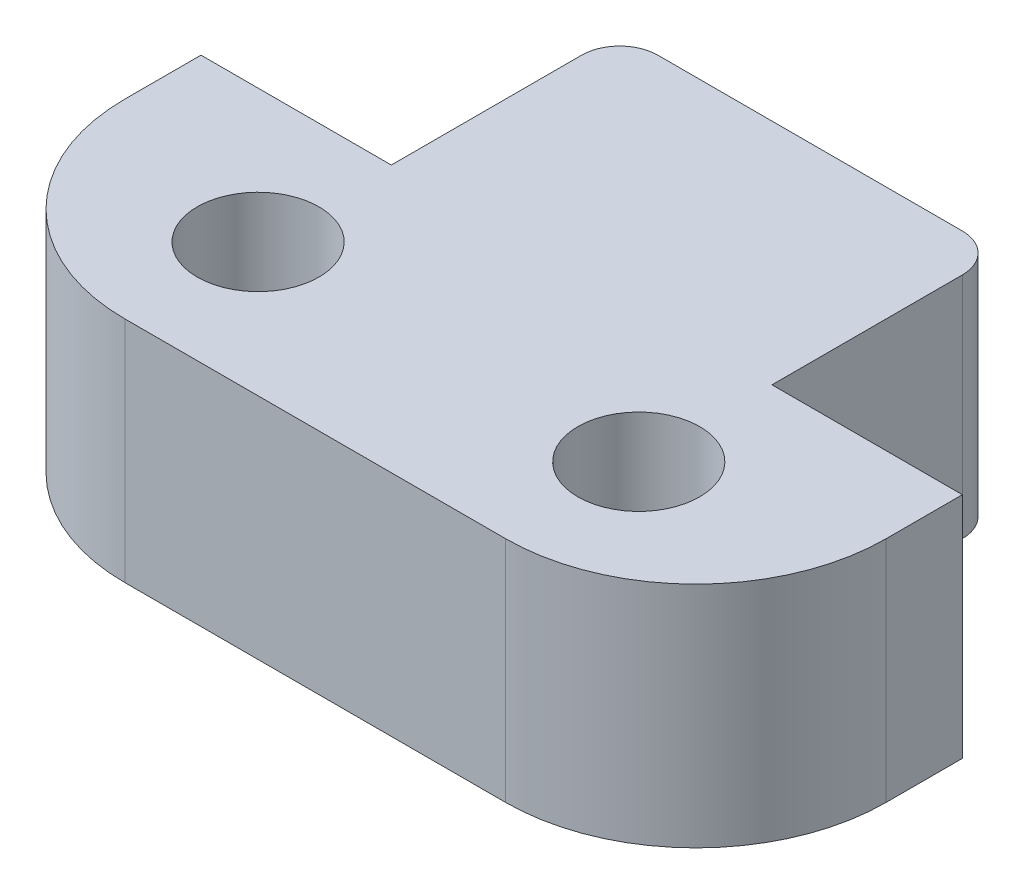
ISO-10303-21;
HEADER;
FILE_DESCRIPTION(('STEP AP214'),'2;1');
FILE_NAME('part.step','',(''),(''),'','','');
FILE_SCHEMA(('AUTOMOTIVE_DESIGN { 1 0 10303 214 1 1 1 1 }'));
ENDSEC;
DATA;
#1=APPLICATION_CONTEXT('core data for automotive mechanical design processes');
#2=APPLICATION_PROTOCOL_DEFINITION('international standard','automotive_design',2000,#1);
#3=PRODUCT_CONTEXT('',#1,'mechanical');
#4=PRODUCT('Part','Part','',(#3));
#5=PRODUCT_RELATED_PRODUCT_CATEGORY('part','',(#4));
#6=PRODUCT_DEFINITION_FORMATION('','',#4);
#7=PRODUCT_DEFINITION_CONTEXT('part definition',#1,'design');
#8=PRODUCT_DEFINITION('design','',#6,#7);
#9=PRODUCT_DEFINITION_SHAPE('','',#8);
#10=(LENGTH_UNIT() NAMED_UNIT(*) SI_UNIT(.MILLI.,.METRE.));
#11=(NAMED_UNIT(*) PLANE_ANGLE_UNIT() SI_UNIT($,.RADIAN.));
#12=(NAMED_UNIT(*) SI_UNIT($,.STERADIAN.) SOLID_ANGLE_UNIT());
#13=UNCERTAINTY_MEASURE_WITH_UNIT(LENGTH_MEASURE(1.E-05),#10,'distance_accuracy_value','');
#14=(GEOMETRIC_REPRESENTATION_CONTEXT(3) GLOBAL_UNCERTAINTY_ASSIGNED_CONTEXT((#13)) GLOBAL_UNIT_ASSIGNED_CONTEXT((#10,
#11,#12)) REPRESENTATION_CONTEXT('',''));
#15=CARTESIAN_POINT('',(0.,0.,0.));
#16=DIRECTION('',(0.,0.,1.));
#17=DIRECTION('',(1.,0.,0.));
#18=AXIS2_PLACEMENT_3D('',#15,#16,#17);
#19=CARTESIAN_POINT('',(-10.,6.,-3.5));
#20=DIRECTION('',(0.,0.,1.));
#21=DIRECTION('',(1.,0.,0.));
#22=AXIS2_PLACEMENT_3D('',#19,#20,#21);
#23=PLANE('',#22);
#24=DIRECTION('',(0.,1.,0.));
#25=VECTOR('',#24,1.);
#26=CARTESIAN_POINT('',(-5.00000000000005,6.00000000000001,-3.5));
#27=LINE('',#26,#25);
#28=CARTESIAN_POINT('',(-5.00000000000006,0.,-3.5));
#29=VERTEX_POINT('',#28);
#30=CARTESIAN_POINT('',(-5.00000000000006,6.,-3.5));
#31=VERTEX_POINT('',#30);
#32=EDGE_CURVE('E152',#29,#31,#27,.T.);
#33=ORIENTED_EDGE('',*,*,#32,.F.);
#34=DIRECTION('',(-1.,0.,0.));
#35=VECTOR('',#34,1.);
#36=CARTESIAN_POINT('',(-10.,0.,-3.5));
#37=LINE('',#36,#35);
#38=CARTESIAN_POINT('',(-10.,0.,-3.5));
#39=VERTEX_POINT('',#38);
#40=EDGE_CURVE('E147',#29,#39,#37,.T.);
#41=ORIENTED_EDGE('',*,*,#40,.T.);
#42=DIRECTION('',(0.,-1.,0.));
#43=VECTOR('',#42,1.);
#44=CARTESIAN_POINT('',(-10.,6.,-3.5));
#45=LINE('',#44,#43);
#46=CARTESIAN_POINT('',(-10.,6.,-3.5));
#47=VERTEX_POINT('',#46);
#48=EDGE_CURVE('E191',#47,#39,#45,.T.);
#49=ORIENTED_EDGE('',*,*,#48,.F.);
#50=DIRECTION('',(-1.,0.,0.));
#51=VECTOR('',#50,1.);
#52=CARTESIAN_POINT('',(-10.,6.,-3.5));
#53=LINE('',#52,#51);
#54=EDGE_CURVE('E163',#31,#47,#53,.T.);
#55=ORIENTED_EDGE('',*,*,#54,.F.);
#56=EDGE_LOOP('',(#33,#41,#49,#55));
#57=FACE_BOUND('',#56,.T.);
#58=ADVANCED_FACE('F33',(#57),#23,.F.);
#59=DIRECTION('',(0.,-1.,0.));
#60=VECTOR('',#59,1.);
#61=CARTESIAN_POINT('',(4.99999999999995,6.,-3.5));
#62=LINE('',#61,#60);
#63=CARTESIAN_POINT('',(4.99999999999994,6.,-3.5));
#64=VERTEX_POINT('',#63);
#65=CARTESIAN_POINT('',(4.99999999999994,0.,-3.5));
#66=VERTEX_POINT('',#65);
#67=EDGE_CURVE('E142',#64,#66,#62,.T.);
#68=ORIENTED_EDGE('',*,*,#67,.F.);
#69=CARTESIAN_POINT('',(10.,6.,-3.5));
#70=VERTEX_POINT('',#69);
#71=EDGE_CURVE('E180',#70,#64,#53,.T.);
#72=ORIENTED_EDGE('',*,*,#71,.F.);
#73=DIRECTION('',(0.,-1.,0.));
#74=VECTOR('',#73,1.);
#75=CARTESIAN_POINT('',(10.,6.,-3.5));
#76=LINE('',#75,#74);
#77=CARTESIAN_POINT('',(10.,0.,-3.5));
#78=VERTEX_POINT('',#77);
#79=EDGE_CURVE('E145',#70,#78,#76,.T.);
#80=ORIENTED_EDGE('',*,*,#79,.T.);
#81=EDGE_CURVE('E128',#78,#66,#37,.T.);
#82=ORIENTED_EDGE('',*,*,#81,.T.);
#83=EDGE_LOOP('',(#68,#72,#80,#82));
#84=FACE_BOUND('',#83,.T.);
#85=ADVANCED_FACE('F140',(#84),#23,.F.);
#86=CARTESIAN_POINT('',(10.,6.,-3.5));
#87=DIRECTION('',(-1.,0.,0.));
#88=DIRECTION('',(0.,0.,1.));
#89=AXIS2_PLACEMENT_3D('',#86,#87,#88);
#90=PLANE('',#89);
#91=DIRECTION('',(0.,0.,-1.));
#92=VECTOR('',#91,1.);
#93=CARTESIAN_POINT('',(10.,6.,-3.5));
#94=LINE('',#93,#92);
#95=CARTESIAN_POINT('',(10.,6.,-1.5));
#96=VERTEX_POINT('',#95);
#97=EDGE_CURVE('E173',#96,#70,#94,.T.);
#98=ORIENTED_EDGE('',*,*,#97,.F.);
#99=DIRECTION('',(0.,-1.,0.));
#100=VECTOR('',#99,1.);
#101=CARTESIAN_POINT('',(10.,6.,-1.5));
#102=LINE('',#101,#100);
#103=CARTESIAN_POINT('',(10.,0.,-1.5));
#104=VERTEX_POINT('',#103);
#105=EDGE_CURVE('E225',#96,#104,#102,.T.);
#106=ORIENTED_EDGE('',*,*,#105,.T.);
#107=DIRECTION('',(0.,0.,-1.));
#108=VECTOR('',#107,1.);
#109=CARTESIAN_POINT('',(10.,0.,-3.5));
#110=LINE('',#109,#108);
#111=EDGE_CURVE('E183',#104,#78,#110,.T.);
#112=ORIENTED_EDGE('',*,*,#111,.T.);
#113=ORIENTED_EDGE('',*,*,#79,.F.);
#114=EDGE_LOOP('',(#98,#106,#112,#113));
#115=FACE_BOUND('',#114,.T.);
#116=ADVANCED_FACE('F249',(#115),#90,.F.);
#117=CARTESIAN_POINT('',(-10.,6.,-3.5));
#118=DIRECTION('',(1.,0.,0.));
#119=DIRECTION('',(0.,0.,-1.));
#120=AXIS2_PLACEMENT_3D('',#117,#118,#119);
#121=PLANE('',#120);
#122=DIRECTION('',(0.,0.,1.));
#123=VECTOR('',#122,1.);
#124=CARTESIAN_POINT('',(-10.,0.,-3.5));
#125=LINE('',#124,#123);
#126=CARTESIAN_POINT('',(-10.,0.,-1.5));
#127=VERTEX_POINT('',#126);
#128=EDGE_CURVE('E146',#39,#127,#125,.T.);
#129=ORIENTED_EDGE('',*,*,#128,.T.);
#130=DIRECTION('',(0.,-1.,0.));
#131=VECTOR('',#130,1.);
#132=CARTESIAN_POINT('',(-10.,6.,-1.5));
#133=LINE('',#132,#131);
#134=CARTESIAN_POINT('',(-10.,6.,-1.5));
#135=VERTEX_POINT('',#134);
#136=EDGE_CURVE('E11',#127,#135,#133,.F.);
#137=ORIENTED_EDGE('',*,*,#136,.T.);
#138=DIRECTION('',(0.,0.,1.));
#139=VECTOR('',#138,1.);
#140=CARTESIAN_POINT('',(-10.,6.,-3.5));
#141=LINE('',#140,#139);
#142=EDGE_CURVE('E177',#47,#135,#141,.T.);
#143=ORIENTED_EDGE('',*,*,#142,.F.);
#144=ORIENTED_EDGE('',*,*,#48,.T.);
#145=EDGE_LOOP('',(#129,#137,#143,#144));
#146=FACE_BOUND('',#145,.T.);
#147=ADVANCED_FACE('F258',(#146),#121,.F.);
#148=CARTESIAN_POINT('',(-10.,6.,3.5));
#149=DIRECTION('',(0.,0.,-1.));
#150=DIRECTION('',(-1.,0.,0.));
#151=AXIS2_PLACEMENT_3D('',#148,#149,#150);
#152=PLANE('',#151);
#153=DIRECTION('',(1.,0.,0.));
#154=VECTOR('',#153,1.);
#155=CARTESIAN_POINT('',(-10.,0.,3.5));
#156=LINE('',#155,#154);
#157=CARTESIAN_POINT('',(-5.,0.,3.5));
#158=VERTEX_POINT('',#157);
#159=CARTESIAN_POINT('',(5.,0.,3.5));
#160=VERTEX_POINT('',#159);
#161=EDGE_CURVE('E174',#158,#160,#156,.T.);
#162=ORIENTED_EDGE('',*,*,#161,.T.);
#163=DIRECTION('',(0.,-1.,0.));
#164=VECTOR('',#163,1.);
#165=CARTESIAN_POINT('',(5.,6.,3.5));
#166=LINE('',#165,#164);
#167=CARTESIAN_POINT('',(5.,6.,3.5));
#168=VERTEX_POINT('',#167);
#169=EDGE_CURVE('E54',#160,#168,#166,.F.);
#170=ORIENTED_EDGE('',*,*,#169,.T.);
#171=DIRECTION('',(1.,0.,0.));
#172=VECTOR('',#171,1.);
#173=CARTESIAN_POINT('',(-10.,6.,3.5));
#174=LINE('',#173,#172);
#175=CARTESIAN_POINT('',(-5.,6.,3.5));
#176=VERTEX_POINT('',#175);
#177=EDGE_CURVE('E193',#176,#168,#174,.T.);
#178=ORIENTED_EDGE('',*,*,#177,.F.);
#179=DIRECTION('',(0.,-1.,0.));
#180=VECTOR('',#179,1.);
#181=CARTESIAN_POINT('',(-5.,6.,3.5));
#182=LINE('',#181,#180);
#183=EDGE_CURVE('E237',#176,#158,#182,.T.);
#184=ORIENTED_EDGE('',*,*,#183,.T.);
#185=EDGE_LOOP('',(#162,#170,#178,#184));
#186=FACE_BOUND('',#185,.T.);
#187=ADVANCED_FACE('F252',(#186),#152,.F.);
#188=CARTESIAN_POINT('',(0.,6.,0.));
#189=DIRECTION('',(0.,1.,0.));
#190=DIRECTION('',(0.,0.,1.));
#191=AXIS2_PLACEMENT_3D('',#188,#189,#190);
#192=PLANE('',#191);
#193=CARTESIAN_POINT('',(-5.,6.,0.));
#194=DIRECTION('',(0.,1.,0.));
#195=DIRECTION('',(0.,0.,1.));
#196=AXIS2_PLACEMENT_3D('',#193,#194,#195);
#197=CIRCLE('',#196,1.59999999999999);
#198=CARTESIAN_POINT('',(-5.,6.,1.59999999999999));
#199=VERTEX_POINT('',#198);
#200=EDGE_CURVE('E230',#199,#199,#197,.T.);
#201=ORIENTED_EDGE('',*,*,#200,.F.);
#202=EDGE_LOOP('',(#201));
#203=FACE_BOUND('',#202,.T.);
#204=CARTESIAN_POINT('',(5.,6.,0.));
#205=DIRECTION('',(0.,1.,0.));
#206=DIRECTION('',(0.,0.,1.));
#207=AXIS2_PLACEMENT_3D('',#204,#205,#206);
#208=CIRCLE('',#207,1.59999999999999);
#209=CARTESIAN_POINT('',(5.,6.,1.59999999999999));
#210=VERTEX_POINT('',#209);
#211=EDGE_CURVE('E229',#210,#210,#208,.T.);
#212=ORIENTED_EDGE('',*,*,#211,.F.);
#213=EDGE_LOOP('',(#212));
#214=FACE_BOUND('',#213,.T.);
#215=ORIENTED_EDGE('',*,*,#177,.T.);
#216=CARTESIAN_POINT('',(5.,6.,-1.5));
#217=DIRECTION('',(0.,1.,0.));
#218=DIRECTION('',(0.,0.,1.));
#219=AXIS2_PLACEMENT_3D('',#216,#217,#218);
#220=CIRCLE('',#219,5.);
#221=EDGE_CURVE('E41',#168,#96,#220,.T.);
#222=ORIENTED_EDGE('',*,*,#221,.T.);
#223=ORIENTED_EDGE('',*,*,#97,.T.);
#224=ORIENTED_EDGE('',*,*,#71,.T.);
#225=DIRECTION('',(0.,0.,1.));
#226=VECTOR('',#225,1.);
#227=CARTESIAN_POINT('',(4.99999999999995,6.,-9.5));
#228=LINE('',#227,#226);
#229=CARTESIAN_POINT('',(4.99999999999995,6.,-8.5));
#230=VERTEX_POINT('',#229);
#231=EDGE_CURVE('E135',#230,#64,#228,.T.);
#232=ORIENTED_EDGE('',*,*,#231,.F.);
#233=CARTESIAN_POINT('',(3.99999999999995,6.,-8.5));
#234=DIRECTION('',(0.,1.,0.));
#235=DIRECTION('',(0.,0.,1.));
#236=AXIS2_PLACEMENT_3D('',#233,#234,#235);
#237=CIRCLE('',#236,1.);
#238=CARTESIAN_POINT('',(3.99999999999995,6.,-9.5));
#239=VERTEX_POINT('',#238);
#240=EDGE_CURVE('E221',#230,#239,#237,.T.);
#241=ORIENTED_EDGE('',*,*,#240,.T.);
#242=DIRECTION('',(1.,0.,0.));
#243=VECTOR('',#242,1.);
#244=CARTESIAN_POINT('',(4.99999999999995,6.,-9.5));
#245=LINE('',#244,#243);
#246=CARTESIAN_POINT('',(-4.00000000000005,6.00000000000001,-9.5));
#247=VERTEX_POINT('',#246);
#248=EDGE_CURVE('E151',#247,#239,#245,.T.);
#249=ORIENTED_EDGE('',*,*,#248,.F.);
#250=CARTESIAN_POINT('',(-4.00000000000005,6.,-8.5));
#251=DIRECTION('',(0.,1.,0.));
#252=DIRECTION('',(0.,0.,1.));
#253=AXIS2_PLACEMENT_3D('',#250,#251,#252);
#254=CIRCLE('',#253,1.);
#255=CARTESIAN_POINT('',(-5.00000000000005,6.00000000000001,-8.5));
#256=VERTEX_POINT('',#255);
#257=EDGE_CURVE('E219',#247,#256,#254,.T.);
#258=ORIENTED_EDGE('',*,*,#257,.T.);
#259=DIRECTION('',(0.,0.,1.));
#260=VECTOR('',#259,1.);
#261=CARTESIAN_POINT('',(-5.00000000000005,6.00000000000001,-9.5));
#262=LINE('',#261,#260);
#263=EDGE_CURVE('E213',#256,#31,#262,.T.);
#264=ORIENTED_EDGE('',*,*,#263,.T.);
#265=ORIENTED_EDGE('',*,*,#54,.T.);
#266=ORIENTED_EDGE('',*,*,#142,.T.);
#267=CARTESIAN_POINT('',(-5.,6.,-1.5));
#268=DIRECTION('',(0.,1.,0.));
#269=DIRECTION('',(0.,0.,1.));
#270=AXIS2_PLACEMENT_3D('',#267,#268,#269);
#271=CIRCLE('',#270,5.);
#272=EDGE_CURVE('E241',#135,#176,#271,.T.);
#273=ORIENTED_EDGE('',*,*,#272,.T.);
#274=EDGE_LOOP('',(#215,#222,#223,#224,#232,#241,#249,#258,#264,#265,#266,#273));
#275=FACE_BOUND('',#274,.T.);
#276=ADVANCED_FACE('F245',(#203,#214,#275),#192,.T.);
#277=CARTESIAN_POINT('',(0.,0.,0.));
#278=DIRECTION('',(0.,1.,0.));
#279=DIRECTION('',(0.,0.,1.));
#280=AXIS2_PLACEMENT_3D('',#277,#278,#279);
#281=PLANE('',#280);
#282=CARTESIAN_POINT('',(-5.,0.,0.));
#283=DIRECTION('',(0.,1.,0.));
#284=DIRECTION('',(0.,0.,1.));
#285=AXIS2_PLACEMENT_3D('',#282,#283,#284);
#286=CIRCLE('',#285,1.59999999999999);
#287=CARTESIAN_POINT('',(-5.,0.,1.59999999999999));
#288=VERTEX_POINT('',#287);
#289=EDGE_CURVE('E226',#288,#288,#286,.T.);
#290=ORIENTED_EDGE('',*,*,#289,.T.);
#291=EDGE_LOOP('',(#290));
#292=FACE_BOUND('',#291,.T.);
#293=CARTESIAN_POINT('',(5.,0.,0.));
#294=DIRECTION('',(0.,1.,0.));
#295=DIRECTION('',(0.,0.,1.));
#296=AXIS2_PLACEMENT_3D('',#293,#294,#295);
#297=CIRCLE('',#296,1.59999999999999);
#298=CARTESIAN_POINT('',(5.,0.,1.59999999999999));
#299=VERTEX_POINT('',#298);
#300=EDGE_CURVE('E158',#299,#299,#297,.T.);
#301=ORIENTED_EDGE('',*,*,#300,.T.);
#302=EDGE_LOOP('',(#301));
#303=FACE_BOUND('',#302,.T.);
#304=ORIENTED_EDGE('',*,*,#111,.F.);
#305=CARTESIAN_POINT('',(5.,0.,-1.5));
#306=DIRECTION('',(0.,1.,0.));
#307=DIRECTION('',(0.,0.,1.));
#308=AXIS2_PLACEMENT_3D('',#305,#306,#307);
#309=CIRCLE('',#308,5.);
#310=EDGE_CURVE('E235',#104,#160,#309,.F.);
#311=ORIENTED_EDGE('',*,*,#310,.T.);
#312=ORIENTED_EDGE('',*,*,#161,.F.);
#313=CARTESIAN_POINT('',(-5.,0.,-1.5));
#314=DIRECTION('',(0.,1.,0.));
#315=DIRECTION('',(0.,0.,1.));
#316=AXIS2_PLACEMENT_3D('',#313,#314,#315);
#317=CIRCLE('',#316,5.);
#318=EDGE_CURVE('E233',#158,#127,#317,.F.);
#319=ORIENTED_EDGE('',*,*,#318,.T.);
#320=ORIENTED_EDGE('',*,*,#128,.F.);
#321=ORIENTED_EDGE('',*,*,#40,.F.);
#322=DIRECTION('',(0.,0.,1.));
#323=VECTOR('',#322,1.);
#324=CARTESIAN_POINT('',(-5.00000000000006,0.,-9.5));
#325=LINE('',#324,#323);
#326=CARTESIAN_POINT('',(-5.00000000000006,0.,-8.5));
#327=VERTEX_POINT('',#326);
#328=EDGE_CURVE('E136',#327,#29,#325,.T.);
#329=ORIENTED_EDGE('',*,*,#328,.F.);
#330=CARTESIAN_POINT('',(-4.00000000000006,0.,-8.5));
#331=DIRECTION('',(0.,1.,0.));
#332=DIRECTION('',(0.,0.,1.));
#333=AXIS2_PLACEMENT_3D('',#330,#331,#332);
#334=CIRCLE('',#333,1.);
#335=CARTESIAN_POINT('',(-4.00000000000006,0.,-9.5));
#336=VERTEX_POINT('',#335);
#337=EDGE_CURVE('E203',#327,#336,#334,.F.);
#338=ORIENTED_EDGE('',*,*,#337,.T.);
#339=DIRECTION('',(-1.,0.,0.));
#340=VECTOR('',#339,1.);
#341=CARTESIAN_POINT('',(4.99999999999994,0.,-9.5));
#342=LINE('',#341,#340);
#343=CARTESIAN_POINT('',(3.99999999999994,0.,-9.5));
#344=VERTEX_POINT('',#343);
#345=EDGE_CURVE('E155',#344,#336,#342,.T.);
#346=ORIENTED_EDGE('',*,*,#345,.F.);
#347=CARTESIAN_POINT('',(3.99999999999994,0.,-8.5));
#348=DIRECTION('',(0.,1.,0.));
#349=DIRECTION('',(0.,0.,1.));
#350=AXIS2_PLACEMENT_3D('',#347,#348,#349);
#351=CIRCLE('',#350,1.);
#352=CARTESIAN_POINT('',(4.99999999999994,0.,-8.5));
#353=VERTEX_POINT('',#352);
#354=EDGE_CURVE('E131',#344,#353,#351,.F.);
#355=ORIENTED_EDGE('',*,*,#354,.T.);
#356=DIRECTION('',(0.,0.,1.));
#357=VECTOR('',#356,1.);
#358=CARTESIAN_POINT('',(4.99999999999994,0.,-9.5));
#359=LINE('',#358,#357);
#360=EDGE_CURVE('E124',#353,#66,#359,.T.);
#361=ORIENTED_EDGE('',*,*,#360,.T.);
#362=ORIENTED_EDGE('',*,*,#81,.F.);
#363=EDGE_LOOP('',(#304,#311,#312,#319,#320,#321,#329,#338,#346,#355,#361,#362));
#364=FACE_BOUND('',#363,.T.);
#365=ADVANCED_FACE('F127',(#292,#303,#364),#281,.F.);
#366=CARTESIAN_POINT('',(-5.00000000000005,6.00000000000001,-9.5));
#367=DIRECTION('',(1.,0.,0.));
#368=DIRECTION('',(0.,1.,0.));
#369=AXIS2_PLACEMENT_3D('',#366,#367,#368);
#370=PLANE('',#369);
#371=ORIENTED_EDGE('',*,*,#263,.F.);
#372=DIRECTION('',(0.,1.,0.));
#373=VECTOR('',#372,1.);
#374=CARTESIAN_POINT('',(-5.00000000000006,0.,-8.5));
#375=LINE('',#374,#373);
#376=EDGE_CURVE('E223',#256,#327,#375,.F.);
#377=ORIENTED_EDGE('',*,*,#376,.T.);
#378=ORIENTED_EDGE('',*,*,#328,.T.);
#379=ORIENTED_EDGE('',*,*,#32,.T.);
#380=EDGE_LOOP('',(#371,#377,#378,#379));
#381=FACE_BOUND('',#380,.T.);
#382=ADVANCED_FACE('F270',(#381),#370,.F.);
#383=CARTESIAN_POINT('',(4.99999999999995,6.,-9.5));
#384=DIRECTION('',(-1.,0.,0.));
#385=DIRECTION('',(0.,-1.,0.));
#386=AXIS2_PLACEMENT_3D('',#383,#384,#385);
#387=PLANE('',#386);
#388=ORIENTED_EDGE('',*,*,#360,.F.);
#389=DIRECTION('',(0.,-1.,0.));
#390=VECTOR('',#389,1.);
#391=CARTESIAN_POINT('',(4.99999999999995,6.,-8.5));
#392=LINE('',#391,#390);
#393=EDGE_CURVE('E211',#353,#230,#392,.F.);
#394=ORIENTED_EDGE('',*,*,#393,.T.);
#395=ORIENTED_EDGE('',*,*,#231,.T.);
#396=ORIENTED_EDGE('',*,*,#67,.T.);
#397=EDGE_LOOP('',(#388,#394,#395,#396));
#398=FACE_BOUND('',#397,.T.);
#399=ADVANCED_FACE('F149',(#398),#387,.F.);
#400=CARTESIAN_POINT('',(0.,0.,-9.5));
#401=DIRECTION('',(0.,0.,-1.));
#402=DIRECTION('',(0.,1.,0.));
#403=AXIS2_PLACEMENT_3D('',#400,#401,#402);
#404=PLANE('',#403);
#405=ORIENTED_EDGE('',*,*,#248,.T.);
#406=DIRECTION('',(0.,-1.,0.));
#407=VECTOR('',#406,1.);
#408=CARTESIAN_POINT('',(3.99999999999994,0.,-9.5));
#409=LINE('',#408,#407);
#410=EDGE_CURVE('E196',#239,#344,#409,.T.);
#411=ORIENTED_EDGE('',*,*,#410,.T.);
#412=ORIENTED_EDGE('',*,*,#345,.T.);
#413=DIRECTION('',(0.,1.,0.));
#414=VECTOR('',#413,1.);
#415=CARTESIAN_POINT('',(-4.00000000000005,6.00000000000001,-9.5));
#416=LINE('',#415,#414);
#417=EDGE_CURVE('E194',#336,#247,#416,.T.);
#418=ORIENTED_EDGE('',*,*,#417,.T.);
#419=EDGE_LOOP('',(#405,#411,#412,#418));
#420=FACE_BOUND('',#419,.T.);
#421=ADVANCED_FACE('F277',(#420),#404,.T.);
#422=CARTESIAN_POINT('',(3.99999999999994,0.,-8.5));
#423=DIRECTION('',(0.,1.,0.));
#424=DIRECTION('',(-1.,0.,0.));
#425=AXIS2_PLACEMENT_3D('',#422,#423,#424);
#426=CYLINDRICAL_SURFACE('',#425,1.);
#427=ORIENTED_EDGE('',*,*,#240,.F.);
#428=ORIENTED_EDGE('',*,*,#393,.F.);
#429=ORIENTED_EDGE('',*,*,#354,.F.);
#430=ORIENTED_EDGE('',*,*,#410,.F.);
#431=EDGE_LOOP('',(#427,#428,#429,#430));
#432=FACE_BOUND('',#431,.T.);
#433=ADVANCED_FACE('F292',(#432),#426,.T.);
#434=CARTESIAN_POINT('',(-4.00000000000006,0.,-8.5));
#435=DIRECTION('',(0.,-1.,0.));
#436=DIRECTION('',(1.,0.,0.));
#437=AXIS2_PLACEMENT_3D('',#434,#435,#436);
#438=CYLINDRICAL_SURFACE('',#437,1.);
#439=ORIENTED_EDGE('',*,*,#337,.F.);
#440=ORIENTED_EDGE('',*,*,#376,.F.);
#441=ORIENTED_EDGE('',*,*,#257,.F.);
#442=ORIENTED_EDGE('',*,*,#417,.F.);
#443=EDGE_LOOP('',(#439,#440,#441,#442));
#444=FACE_BOUND('',#443,.T.);
#445=ADVANCED_FACE('F268',(#444),#438,.T.);
#446=CARTESIAN_POINT('',(5.,6.,0.));
#447=DIRECTION('',(0.,1.,0.));
#448=DIRECTION('',(0.,0.,1.));
#449=AXIS2_PLACEMENT_3D('',#446,#447,#448);
#450=CYLINDRICAL_SURFACE('',#449,1.59999999999999);
#451=ORIENTED_EDGE('',*,*,#211,.T.);
#452=EDGE_LOOP('',(#451));
#453=FACE_BOUND('',#452,.T.);
#454=ORIENTED_EDGE('',*,*,#300,.F.);
#455=EDGE_LOOP('',(#454));
#456=FACE_BOUND('',#455,.T.);
#457=ADVANCED_FACE('F297',(#453,#456),#450,.F.);
#458=CARTESIAN_POINT('',(-5.,6.,0.));
#459=DIRECTION('',(0.,1.,0.));
#460=DIRECTION('',(0.,0.,1.));
#461=AXIS2_PLACEMENT_3D('',#458,#459,#460);
#462=CYLINDRICAL_SURFACE('',#461,1.59999999999999);
#463=ORIENTED_EDGE('',*,*,#200,.T.);
#464=EDGE_LOOP('',(#463));
#465=FACE_BOUND('',#464,.T.);
#466=ORIENTED_EDGE('',*,*,#289,.F.);
#467=EDGE_LOOP('',(#466));
#468=FACE_BOUND('',#467,.T.);
#469=ADVANCED_FACE('F299',(#465,#468),#462,.F.);
#470=CARTESIAN_POINT('',(5.,6.,-1.5));
#471=DIRECTION('',(0.,-1.,0.));
#472=DIRECTION('',(0.,0.,-1.));
#473=AXIS2_PLACEMENT_3D('',#470,#471,#472);
#474=CYLINDRICAL_SURFACE('',#473,5.);
#475=ORIENTED_EDGE('',*,*,#221,.F.);
#476=ORIENTED_EDGE('',*,*,#169,.F.);
#477=ORIENTED_EDGE('',*,*,#310,.F.);
#478=ORIENTED_EDGE('',*,*,#105,.F.);
#479=EDGE_LOOP('',(#475,#476,#477,#478));
#480=FACE_BOUND('',#479,.T.);
#481=ADVANCED_FACE('F250',(#480),#474,.T.);
#482=CARTESIAN_POINT('',(-5.,6.,-1.5));
#483=DIRECTION('',(0.,-1.,0.));
#484=DIRECTION('',(0.,0.,-1.));
#485=AXIS2_PLACEMENT_3D('',#482,#483,#484);
#486=CYLINDRICAL_SURFACE('',#485,5.);
#487=ORIENTED_EDGE('',*,*,#272,.F.);
#488=ORIENTED_EDGE('',*,*,#136,.F.);
#489=ORIENTED_EDGE('',*,*,#318,.F.);
#490=ORIENTED_EDGE('',*,*,#183,.F.);
#491=EDGE_LOOP('',(#487,#488,#489,#490));
#492=FACE_BOUND('',#491,.T.);
#493=ADVANCED_FACE('F35',(#492),#486,.T.);
#494=CLOSED_SHELL('',(#58,#85,#116,#147,#187,#276,#365,#382,#399,#421,#433,#445,#457,#469,#481,#493));
#495=MANIFOLD_SOLID_BREP('B2',#494);
#496=ADVANCED_BREP_SHAPE_REPRESENTATION('',(#18,#495),#14);
#497=SHAPE_DEFINITION_REPRESENTATION(#9,#496);
ENDSEC;
END-ISO-10303-21;
